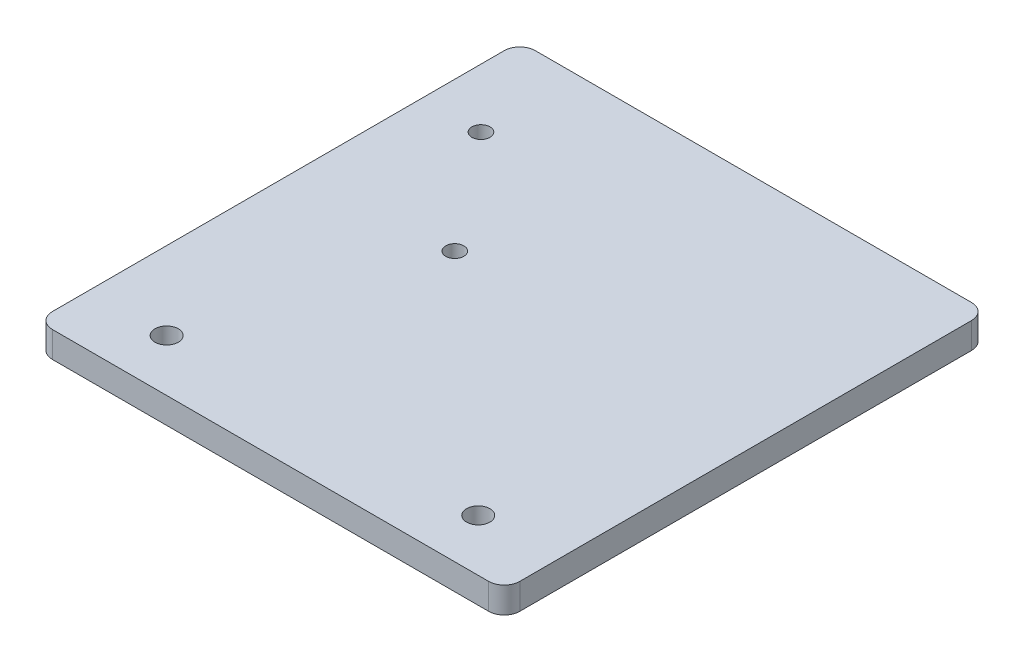
ISO-10303-21;
HEADER;
FILE_DESCRIPTION(('STEP AP214'),'2;1');
FILE_NAME('part.step','',(''),(''),'','','');
FILE_SCHEMA(('AUTOMOTIVE_DESIGN { 1 0 10303 214 1 1 1 1 }'));
ENDSEC;
DATA;
#1=APPLICATION_CONTEXT('core data for automotive mechanical design processes');
#2=APPLICATION_PROTOCOL_DEFINITION('international standard','automotive_design',2000,#1);
#3=PRODUCT_CONTEXT('',#1,'mechanical');
#4=PRODUCT('Part','Part','',(#3));
#5=PRODUCT_RELATED_PRODUCT_CATEGORY('part','',(#4));
#6=PRODUCT_DEFINITION_FORMATION('','',#4);
#7=PRODUCT_DEFINITION_CONTEXT('part definition',#1,'design');
#8=PRODUCT_DEFINITION('design','',#6,#7);
#9=PRODUCT_DEFINITION_SHAPE('','',#8);
#10=(LENGTH_UNIT() NAMED_UNIT(*) SI_UNIT(.MILLI.,.METRE.));
#11=(NAMED_UNIT(*) PLANE_ANGLE_UNIT() SI_UNIT($,.RADIAN.));
#12=(NAMED_UNIT(*) SI_UNIT($,.STERADIAN.) SOLID_ANGLE_UNIT());
#13=UNCERTAINTY_MEASURE_WITH_UNIT(LENGTH_MEASURE(1.E-05),#10,'distance_accuracy_value','');
#14=(GEOMETRIC_REPRESENTATION_CONTEXT(3) GLOBAL_UNCERTAINTY_ASSIGNED_CONTEXT((#13)) GLOBAL_UNIT_ASSIGNED_CONTEXT((#10,
#11,#12)) REPRESENTATION_CONTEXT('',''));
#15=CARTESIAN_POINT('',(0.,0.,0.));
#16=DIRECTION('',(0.,0.,1.));
#17=DIRECTION('',(1.,0.,0.));
#18=AXIS2_PLACEMENT_3D('',#15,#16,#17);
#19=CARTESIAN_POINT('',(0.,5.,0.));
#20=DIRECTION('',(0.,1.,0.));
#21=DIRECTION('',(0.,0.,1.));
#22=AXIS2_PLACEMENT_3D('',#19,#20,#21);
#23=PLANE('',#22);
#24=CARTESIAN_POINT('',(30.,5.,36.5));
#25=DIRECTION('',(0.,1.,0.));
#26=DIRECTION('',(0.,0.,-1.));
#27=AXIS2_PLACEMENT_3D('',#24,#25,#26);
#28=CIRCLE('',#27,2.25);
#29=CARTESIAN_POINT('',(30.,5.,34.25));
#30=VERTEX_POINT('',#29);
#31=EDGE_CURVE('E191',#30,#30,#28,.T.);
#32=ORIENTED_EDGE('',*,*,#31,.F.);
#33=EDGE_LOOP('',(#32));
#34=FACE_BOUND('',#33,.T.);
#35=CARTESIAN_POINT('',(-30.,5.,36.5));
#36=DIRECTION('',(0.,1.,0.));
#37=DIRECTION('',(0.,0.,1.));
#38=AXIS2_PLACEMENT_3D('',#35,#36,#37);
#39=CIRCLE('',#38,2.25);
#40=CARTESIAN_POINT('',(-30.,5.,38.75));
#41=VERTEX_POINT('',#40);
#42=EDGE_CURVE('E129',#41,#41,#39,.T.);
#43=ORIENTED_EDGE('',*,*,#42,.F.);
#44=EDGE_LOOP('',(#43));
#45=FACE_BOUND('',#44,.T.);
#46=DIRECTION('',(1.,0.,0.));
#47=VECTOR('',#46,1.);
#48=CARTESIAN_POINT('',(-45.,5.,46.5));
#49=LINE('',#48,#47);
#50=CARTESIAN_POINT('',(-42.,5.,46.5));
#51=VERTEX_POINT('',#50);
#52=CARTESIAN_POINT('',(42.,5.,46.5));
#53=VERTEX_POINT('',#52);
#54=EDGE_CURVE('E138',#51,#53,#49,.T.);
#55=ORIENTED_EDGE('',*,*,#54,.T.);
#56=CARTESIAN_POINT('',(42.,5.,43.5));
#57=DIRECTION('',(0.,1.,0.));
#58=DIRECTION('',(0.,0.,1.));
#59=AXIS2_PLACEMENT_3D('',#56,#57,#58);
#60=CIRCLE('',#59,3.);
#61=CARTESIAN_POINT('',(45.,5.,43.5));
#62=VERTEX_POINT('',#61);
#63=EDGE_CURVE('E156',#53,#62,#60,.T.);
#64=ORIENTED_EDGE('',*,*,#63,.T.);
#65=DIRECTION('',(0.,0.,-1.));
#66=VECTOR('',#65,1.);
#67=CARTESIAN_POINT('',(45.,5.,-46.5));
#68=LINE('',#67,#66);
#69=CARTESIAN_POINT('',(45.,5.,-43.5));
#70=VERTEX_POINT('',#69);
#71=EDGE_CURVE('E120',#62,#70,#68,.T.);
#72=ORIENTED_EDGE('',*,*,#71,.T.);
#73=CARTESIAN_POINT('',(42.,5.,-43.5));
#74=DIRECTION('',(0.,1.,0.));
#75=DIRECTION('',(0.,0.,1.));
#76=AXIS2_PLACEMENT_3D('',#73,#74,#75);
#77=CIRCLE('',#76,3.);
#78=CARTESIAN_POINT('',(42.,5.,-46.5));
#79=VERTEX_POINT('',#78);
#80=EDGE_CURVE('E152',#70,#79,#77,.T.);
#81=ORIENTED_EDGE('',*,*,#80,.T.);
#82=DIRECTION('',(-1.,0.,0.));
#83=VECTOR('',#82,1.);
#84=CARTESIAN_POINT('',(-45.,5.,-46.5));
#85=LINE('',#84,#83);
#86=CARTESIAN_POINT('',(-42.,5.,-46.5));
#87=VERTEX_POINT('',#86);
#88=EDGE_CURVE('E165',#79,#87,#85,.T.);
#89=ORIENTED_EDGE('',*,*,#88,.T.);
#90=CARTESIAN_POINT('',(-42.,5.,-43.5));
#91=DIRECTION('',(0.,1.,0.));
#92=DIRECTION('',(0.,0.,1.));
#93=AXIS2_PLACEMENT_3D('',#90,#91,#92);
#94=CIRCLE('',#93,3.);
#95=CARTESIAN_POINT('',(-45.,5.,-43.5));
#96=VERTEX_POINT('',#95);
#97=EDGE_CURVE('E55',#87,#96,#94,.T.);
#98=ORIENTED_EDGE('',*,*,#97,.T.);
#99=DIRECTION('',(0.,0.,1.));
#100=VECTOR('',#99,1.);
#101=CARTESIAN_POINT('',(-45.,5.,-46.5));
#102=LINE('',#101,#100);
#103=CARTESIAN_POINT('',(-45.,5.,43.5));
#104=VERTEX_POINT('',#103);
#105=EDGE_CURVE('E171',#96,#104,#102,.T.);
#106=ORIENTED_EDGE('',*,*,#105,.T.);
#107=CARTESIAN_POINT('',(-42.,5.,43.5));
#108=DIRECTION('',(0.,1.,0.));
#109=DIRECTION('',(0.,0.,1.));
#110=AXIS2_PLACEMENT_3D('',#107,#108,#109);
#111=CIRCLE('',#110,3.);
#112=EDGE_CURVE('E154',#104,#51,#111,.T.);
#113=ORIENTED_EDGE('',*,*,#112,.T.);
#114=EDGE_LOOP('',(#55,#64,#72,#81,#89,#98,#106,#113));
#115=FACE_BOUND('',#114,.T.);
#116=CARTESIAN_POINT('',(-33.66,5.,-27.68));
#117=DIRECTION('',(0.,1.,0.));
#118=DIRECTION('',(0.,0.,1.));
#119=AXIS2_PLACEMENT_3D('',#116,#117,#118);
#120=CIRCLE('',#119,1.75);
#121=CARTESIAN_POINT('',(-33.66,5.,-25.93));
#122=VERTEX_POINT('',#121);
#123=EDGE_CURVE('E186',#122,#122,#120,.T.);
#124=ORIENTED_EDGE('',*,*,#123,.F.);
#125=EDGE_LOOP('',(#124));
#126=FACE_BOUND('',#125,.T.);
#127=CARTESIAN_POINT('',(-16.34,5.,-5.31999999999998));
#128=DIRECTION('',(0.,1.,0.));
#129=DIRECTION('',(0.,0.,1.));
#130=AXIS2_PLACEMENT_3D('',#127,#128,#129);
#131=CIRCLE('',#130,1.75);
#132=CARTESIAN_POINT('',(-16.34,5.,-3.56999999999998));
#133=VERTEX_POINT('',#132);
#134=EDGE_CURVE('E197',#133,#133,#131,.T.);
#135=ORIENTED_EDGE('',*,*,#134,.F.);
#136=EDGE_LOOP('',(#135));
#137=FACE_BOUND('',#136,.T.);
#138=ADVANCED_FACE('F33',(#34,#45,#115,#126,#137),#23,.T.);
#139=CARTESIAN_POINT('',(0.,0.,0.));
#140=DIRECTION('',(0.,1.,0.));
#141=DIRECTION('',(0.,0.,1.));
#142=AXIS2_PLACEMENT_3D('',#139,#140,#141);
#143=PLANE('',#142);
#144=DIRECTION('',(0.,0.,-1.));
#145=VECTOR('',#144,1.);
#146=CARTESIAN_POINT('',(45.,0.,-46.5));
#147=LINE('',#146,#145);
#148=CARTESIAN_POINT('',(45.,0.,43.5));
#149=VERTEX_POINT('',#148);
#150=CARTESIAN_POINT('',(45.,0.,-43.5));
#151=VERTEX_POINT('',#150);
#152=EDGE_CURVE('E117',#149,#151,#147,.T.);
#153=ORIENTED_EDGE('',*,*,#152,.F.);
#154=CARTESIAN_POINT('',(42.,0.,43.5));
#155=DIRECTION('',(0.,1.,0.));
#156=DIRECTION('',(0.,0.,1.));
#157=AXIS2_PLACEMENT_3D('',#154,#155,#156);
#158=CIRCLE('',#157,3.);
#159=CARTESIAN_POINT('',(42.,0.,46.5));
#160=VERTEX_POINT('',#159);
#161=EDGE_CURVE('E100',#149,#160,#158,.F.);
#162=ORIENTED_EDGE('',*,*,#161,.T.);
#163=DIRECTION('',(1.,0.,0.));
#164=VECTOR('',#163,1.);
#165=CARTESIAN_POINT('',(-45.,0.,46.5));
#166=LINE('',#165,#164);
#167=CARTESIAN_POINT('',(-42.,0.,46.5));
#168=VERTEX_POINT('',#167);
#169=EDGE_CURVE('E142',#168,#160,#166,.T.);
#170=ORIENTED_EDGE('',*,*,#169,.F.);
#171=CARTESIAN_POINT('',(-42.,0.,43.5));
#172=DIRECTION('',(0.,1.,0.));
#173=DIRECTION('',(0.,0.,1.));
#174=AXIS2_PLACEMENT_3D('',#171,#172,#173);
#175=CIRCLE('',#174,3.);
#176=CARTESIAN_POINT('',(-45.,0.,43.5));
#177=VERTEX_POINT('',#176);
#178=EDGE_CURVE('E111',#168,#177,#175,.F.);
#179=ORIENTED_EDGE('',*,*,#178,.T.);
#180=DIRECTION('',(0.,0.,1.));
#181=VECTOR('',#180,1.);
#182=CARTESIAN_POINT('',(-45.,0.,-46.5));
#183=LINE('',#182,#181);
#184=CARTESIAN_POINT('',(-45.,0.,-43.5));
#185=VERTEX_POINT('',#184);
#186=EDGE_CURVE('E132',#185,#177,#183,.T.);
#187=ORIENTED_EDGE('',*,*,#186,.F.);
#188=CARTESIAN_POINT('',(-42.,0.,-43.5));
#189=DIRECTION('',(0.,1.,0.));
#190=DIRECTION('',(0.,0.,1.));
#191=AXIS2_PLACEMENT_3D('',#188,#189,#190);
#192=CIRCLE('',#191,3.);
#193=CARTESIAN_POINT('',(-42.,0.,-46.5));
#194=VERTEX_POINT('',#193);
#195=EDGE_CURVE('E121',#185,#194,#192,.F.);
#196=ORIENTED_EDGE('',*,*,#195,.T.);
#197=DIRECTION('',(-1.,0.,0.));
#198=VECTOR('',#197,1.);
#199=CARTESIAN_POINT('',(-45.,0.,-46.5));
#200=LINE('',#199,#198);
#201=CARTESIAN_POINT('',(42.,0.,-46.5));
#202=VERTEX_POINT('',#201);
#203=EDGE_CURVE('E128',#202,#194,#200,.T.);
#204=ORIENTED_EDGE('',*,*,#203,.F.);
#205=CARTESIAN_POINT('',(42.,0.,-43.5));
#206=DIRECTION('',(0.,1.,0.));
#207=DIRECTION('',(0.,0.,1.));
#208=AXIS2_PLACEMENT_3D('',#205,#206,#207);
#209=CIRCLE('',#208,3.);
#210=EDGE_CURVE('E127',#202,#151,#209,.F.);
#211=ORIENTED_EDGE('',*,*,#210,.T.);
#212=EDGE_LOOP('',(#153,#162,#170,#179,#187,#196,#204,#211));
#213=FACE_BOUND('',#212,.T.);
#214=CARTESIAN_POINT('',(-30.,0.,36.5));
#215=DIRECTION('',(0.,1.,0.));
#216=DIRECTION('',(0.,0.,1.));
#217=AXIS2_PLACEMENT_3D('',#214,#215,#216);
#218=CIRCLE('',#217,2.25);
#219=CARTESIAN_POINT('',(-30.,0.,38.75));
#220=VERTEX_POINT('',#219);
#221=EDGE_CURVE('E135',#220,#220,#218,.T.);
#222=ORIENTED_EDGE('',*,*,#221,.T.);
#223=EDGE_LOOP('',(#222));
#224=FACE_BOUND('',#223,.T.);
#225=CARTESIAN_POINT('',(-33.66,0.,-27.68));
#226=DIRECTION('',(0.,1.,0.));
#227=DIRECTION('',(0.,0.,1.));
#228=AXIS2_PLACEMENT_3D('',#225,#226,#227);
#229=CIRCLE('',#228,1.75);
#230=CARTESIAN_POINT('',(-33.66,0.,-25.93));
#231=VERTEX_POINT('',#230);
#232=EDGE_CURVE('E188',#231,#231,#229,.T.);
#233=ORIENTED_EDGE('',*,*,#232,.T.);
#234=EDGE_LOOP('',(#233));
#235=FACE_BOUND('',#234,.T.);
#236=CARTESIAN_POINT('',(30.,0.,36.5));
#237=DIRECTION('',(0.,1.,0.));
#238=DIRECTION('',(0.,0.,-1.));
#239=AXIS2_PLACEMENT_3D('',#236,#237,#238);
#240=CIRCLE('',#239,2.25);
#241=CARTESIAN_POINT('',(30.,0.,34.25));
#242=VERTEX_POINT('',#241);
#243=EDGE_CURVE('E194',#242,#242,#240,.T.);
#244=ORIENTED_EDGE('',*,*,#243,.T.);
#245=EDGE_LOOP('',(#244));
#246=FACE_BOUND('',#245,.T.);
#247=CARTESIAN_POINT('',(-16.34,0.,-5.31999999999998));
#248=DIRECTION('',(0.,1.,0.));
#249=DIRECTION('',(0.,0.,1.));
#250=AXIS2_PLACEMENT_3D('',#247,#248,#249);
#251=CIRCLE('',#250,1.75);
#252=CARTESIAN_POINT('',(-16.34,0.,-3.56999999999998));
#253=VERTEX_POINT('',#252);
#254=EDGE_CURVE('E200',#253,#253,#251,.T.);
#255=ORIENTED_EDGE('',*,*,#254,.T.);
#256=EDGE_LOOP('',(#255));
#257=FACE_BOUND('',#256,.T.);
#258=ADVANCED_FACE('F124',(#213,#224,#235,#246,#257),#143,.F.);
#259=CARTESIAN_POINT('',(45.,5.,-46.5));
#260=DIRECTION('',(-1.,0.,0.));
#261=DIRECTION('',(0.,0.,1.));
#262=AXIS2_PLACEMENT_3D('',#259,#260,#261);
#263=PLANE('',#262);
#264=ORIENTED_EDGE('',*,*,#71,.F.);
#265=DIRECTION('',(0.,-1.,0.));
#266=VECTOR('',#265,1.);
#267=CARTESIAN_POINT('',(45.,5.,43.5));
#268=LINE('',#267,#266);
#269=EDGE_CURVE('E104',#62,#149,#268,.T.);
#270=ORIENTED_EDGE('',*,*,#269,.T.);
#271=ORIENTED_EDGE('',*,*,#152,.T.);
#272=DIRECTION('',(0.,-1.,0.));
#273=VECTOR('',#272,1.);
#274=CARTESIAN_POINT('',(45.,5.,-43.5));
#275=LINE('',#274,#273);
#276=EDGE_CURVE('E122',#151,#70,#275,.F.);
#277=ORIENTED_EDGE('',*,*,#276,.T.);
#278=EDGE_LOOP('',(#264,#270,#271,#277));
#279=FACE_BOUND('',#278,.T.);
#280=ADVANCED_FACE('F116',(#279),#263,.F.);
#281=CARTESIAN_POINT('',(-45.,5.,-46.5));
#282=DIRECTION('',(0.,0.,1.));
#283=DIRECTION('',(1.,0.,0.));
#284=AXIS2_PLACEMENT_3D('',#281,#282,#283);
#285=PLANE('',#284);
#286=ORIENTED_EDGE('',*,*,#88,.F.);
#287=DIRECTION('',(0.,-1.,0.));
#288=VECTOR('',#287,1.);
#289=CARTESIAN_POINT('',(42.,5.,-46.5));
#290=LINE('',#289,#288);
#291=EDGE_CURVE('E11',#79,#202,#290,.T.);
#292=ORIENTED_EDGE('',*,*,#291,.T.);
#293=ORIENTED_EDGE('',*,*,#203,.T.);
#294=DIRECTION('',(0.,-1.,0.));
#295=VECTOR('',#294,1.);
#296=CARTESIAN_POINT('',(-42.,5.,-46.5));
#297=LINE('',#296,#295);
#298=EDGE_CURVE('E41',#194,#87,#297,.F.);
#299=ORIENTED_EDGE('',*,*,#298,.T.);
#300=EDGE_LOOP('',(#286,#292,#293,#299));
#301=FACE_BOUND('',#300,.T.);
#302=ADVANCED_FACE('F164',(#301),#285,.F.);
#303=CARTESIAN_POINT('',(-45.,5.,-46.5));
#304=DIRECTION('',(1.,0.,0.));
#305=DIRECTION('',(0.,0.,-1.));
#306=AXIS2_PLACEMENT_3D('',#303,#304,#305);
#307=PLANE('',#306);
#308=ORIENTED_EDGE('',*,*,#186,.T.);
#309=DIRECTION('',(0.,-1.,0.));
#310=VECTOR('',#309,1.);
#311=CARTESIAN_POINT('',(-45.,5.,43.5));
#312=LINE('',#311,#310);
#313=EDGE_CURVE('E48',#177,#104,#312,.F.);
#314=ORIENTED_EDGE('',*,*,#313,.T.);
#315=ORIENTED_EDGE('',*,*,#105,.F.);
#316=DIRECTION('',(0.,-1.,0.));
#317=VECTOR('',#316,1.);
#318=CARTESIAN_POINT('',(-45.,5.,-43.5));
#319=LINE('',#318,#317);
#320=EDGE_CURVE('E158',#96,#185,#319,.T.);
#321=ORIENTED_EDGE('',*,*,#320,.T.);
#322=EDGE_LOOP('',(#308,#314,#315,#321));
#323=FACE_BOUND('',#322,.T.);
#324=ADVANCED_FACE('F175',(#323),#307,.F.);
#325=CARTESIAN_POINT('',(-45.,5.,46.5));
#326=DIRECTION('',(0.,0.,-1.));
#327=DIRECTION('',(-1.,0.,0.));
#328=AXIS2_PLACEMENT_3D('',#325,#326,#327);
#329=PLANE('',#328);
#330=ORIENTED_EDGE('',*,*,#169,.T.);
#331=DIRECTION('',(0.,-1.,0.));
#332=VECTOR('',#331,1.);
#333=CARTESIAN_POINT('',(42.,5.,46.5));
#334=LINE('',#333,#332);
#335=EDGE_CURVE('E105',#160,#53,#334,.F.);
#336=ORIENTED_EDGE('',*,*,#335,.T.);
#337=ORIENTED_EDGE('',*,*,#54,.F.);
#338=DIRECTION('',(0.,-1.,0.));
#339=VECTOR('',#338,1.);
#340=CARTESIAN_POINT('',(-42.,5.,46.5));
#341=LINE('',#340,#339);
#342=EDGE_CURVE('E110',#51,#168,#341,.T.);
#343=ORIENTED_EDGE('',*,*,#342,.T.);
#344=EDGE_LOOP('',(#330,#336,#337,#343));
#345=FACE_BOUND('',#344,.T.);
#346=ADVANCED_FACE('F182',(#345),#329,.F.);
#347=CARTESIAN_POINT('',(-30.,5.,36.5));
#348=DIRECTION('',(0.,-1.,0.));
#349=DIRECTION('',(0.,0.,-1.));
#350=AXIS2_PLACEMENT_3D('',#347,#348,#349);
#351=CYLINDRICAL_SURFACE('',#350,2.25);
#352=ORIENTED_EDGE('',*,*,#42,.T.);
#353=EDGE_LOOP('',(#352));
#354=FACE_BOUND('',#353,.T.);
#355=ORIENTED_EDGE('',*,*,#221,.F.);
#356=EDGE_LOOP('',(#355));
#357=FACE_BOUND('',#356,.T.);
#358=ADVANCED_FACE('F219',(#354,#357),#351,.F.);
#359=CARTESIAN_POINT('',(-33.66,5.,-27.68));
#360=DIRECTION('',(0.,-1.,0.));
#361=DIRECTION('',(0.,0.,-1.));
#362=AXIS2_PLACEMENT_3D('',#359,#360,#361);
#363=CYLINDRICAL_SURFACE('',#362,1.75);
#364=ORIENTED_EDGE('',*,*,#123,.T.);
#365=EDGE_LOOP('',(#364));
#366=FACE_BOUND('',#365,.T.);
#367=ORIENTED_EDGE('',*,*,#232,.F.);
#368=EDGE_LOOP('',(#367));
#369=FACE_BOUND('',#368,.T.);
#370=ADVANCED_FACE('F311',(#366,#369),#363,.F.);
#371=CARTESIAN_POINT('',(30.,5.,36.5));
#372=DIRECTION('',(0.,-1.,0.));
#373=DIRECTION('',(0.,0.,-1.));
#374=AXIS2_PLACEMENT_3D('',#371,#372,#373);
#375=CYLINDRICAL_SURFACE('',#374,2.25);
#376=ORIENTED_EDGE('',*,*,#31,.T.);
#377=EDGE_LOOP('',(#376));
#378=FACE_BOUND('',#377,.T.);
#379=ORIENTED_EDGE('',*,*,#243,.F.);
#380=EDGE_LOOP('',(#379));
#381=FACE_BOUND('',#380,.T.);
#382=ADVANCED_FACE('F302',(#378,#381),#375,.F.);
#383=CARTESIAN_POINT('',(-16.34,5.,-5.31999999999998));
#384=DIRECTION('',(0.,-1.,0.));
#385=DIRECTION('',(0.,0.,-1.));
#386=AXIS2_PLACEMENT_3D('',#383,#384,#385);
#387=CYLINDRICAL_SURFACE('',#386,1.75);
#388=ORIENTED_EDGE('',*,*,#134,.T.);
#389=EDGE_LOOP('',(#388));
#390=FACE_BOUND('',#389,.T.);
#391=ORIENTED_EDGE('',*,*,#254,.F.);
#392=EDGE_LOOP('',(#391));
#393=FACE_BOUND('',#392,.T.);
#394=ADVANCED_FACE('F206',(#390,#393),#387,.F.);
#395=CARTESIAN_POINT('',(42.,5.,43.5));
#396=DIRECTION('',(0.,-1.,0.));
#397=DIRECTION('',(0.,0.,-1.));
#398=AXIS2_PLACEMENT_3D('',#395,#396,#397);
#399=CYLINDRICAL_SURFACE('',#398,3.);
#400=ORIENTED_EDGE('',*,*,#63,.F.);
#401=ORIENTED_EDGE('',*,*,#335,.F.);
#402=ORIENTED_EDGE('',*,*,#161,.F.);
#403=ORIENTED_EDGE('',*,*,#269,.F.);
#404=EDGE_LOOP('',(#400,#401,#402,#403));
#405=FACE_BOUND('',#404,.T.);
#406=ADVANCED_FACE('F103',(#405),#399,.T.);
#407=CARTESIAN_POINT('',(-42.,5.,43.5));
#408=DIRECTION('',(0.,-1.,0.));
#409=DIRECTION('',(0.,0.,-1.));
#410=AXIS2_PLACEMENT_3D('',#407,#408,#409);
#411=CYLINDRICAL_SURFACE('',#410,3.);
#412=ORIENTED_EDGE('',*,*,#112,.F.);
#413=ORIENTED_EDGE('',*,*,#313,.F.);
#414=ORIENTED_EDGE('',*,*,#178,.F.);
#415=ORIENTED_EDGE('',*,*,#342,.F.);
#416=EDGE_LOOP('',(#412,#413,#414,#415));
#417=FACE_BOUND('',#416,.T.);
#418=ADVANCED_FACE('F179',(#417),#411,.T.);
#419=CARTESIAN_POINT('',(42.,5.,-43.5));
#420=DIRECTION('',(0.,-1.,0.));
#421=DIRECTION('',(0.,0.,-1.));
#422=AXIS2_PLACEMENT_3D('',#419,#420,#421);
#423=CYLINDRICAL_SURFACE('',#422,3.);
#424=ORIENTED_EDGE('',*,*,#80,.F.);
#425=ORIENTED_EDGE('',*,*,#276,.F.);
#426=ORIENTED_EDGE('',*,*,#210,.F.);
#427=ORIENTED_EDGE('',*,*,#291,.F.);
#428=EDGE_LOOP('',(#424,#425,#426,#427));
#429=FACE_BOUND('',#428,.T.);
#430=ADVANCED_FACE('F233',(#429),#423,.T.);
#431=CARTESIAN_POINT('',(-42.,5.,-43.5));
#432=DIRECTION('',(0.,-1.,0.));
#433=DIRECTION('',(0.,0.,-1.));
#434=AXIS2_PLACEMENT_3D('',#431,#432,#433);
#435=CYLINDRICAL_SURFACE('',#434,3.);
#436=ORIENTED_EDGE('',*,*,#97,.F.);
#437=ORIENTED_EDGE('',*,*,#298,.F.);
#438=ORIENTED_EDGE('',*,*,#195,.F.);
#439=ORIENTED_EDGE('',*,*,#320,.F.);
#440=EDGE_LOOP('',(#436,#437,#438,#439));
#441=FACE_BOUND('',#440,.T.);
#442=ADVANCED_FACE('F35',(#441),#435,.T.);
#443=CLOSED_SHELL('',(#138,#258,#280,#302,#324,#346,#358,#370,#382,#394,#406,#418,#430,#442));
#444=MANIFOLD_SOLID_BREP('B2',#443);
#445=ADVANCED_BREP_SHAPE_REPRESENTATION('',(#18,#444),#14);
#446=SHAPE_DEFINITION_REPRESENTATION(#9,#445);
ENDSEC;
END-ISO-10303-21;
